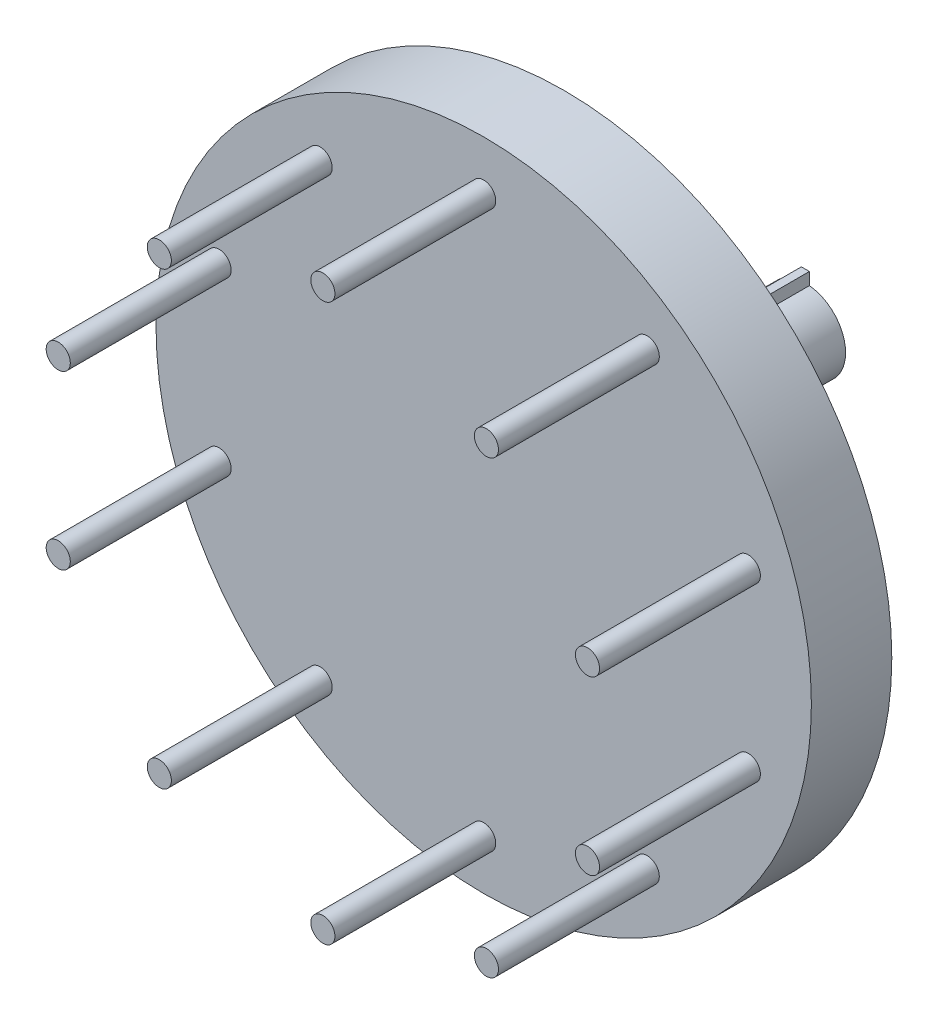
ISO-10303-21;
HEADER;
FILE_DESCRIPTION(('STEP AP214'),'2;1');
FILE_NAME('part.step','',(''),(''),'','','');
FILE_SCHEMA(('AUTOMOTIVE_DESIGN { 1 0 10303 214 1 1 1 1 }'));
ENDSEC;
DATA;
#1=APPLICATION_CONTEXT('core data for automotive mechanical design processes');
#2=APPLICATION_PROTOCOL_DEFINITION('international standard','automotive_design',2000,#1);
#3=PRODUCT_CONTEXT('',#1,'mechanical');
#4=PRODUCT('Part','Part','',(#3));
#5=PRODUCT_RELATED_PRODUCT_CATEGORY('part','',(#4));
#6=PRODUCT_DEFINITION_FORMATION('','',#4);
#7=PRODUCT_DEFINITION_CONTEXT('part definition',#1,'design');
#8=PRODUCT_DEFINITION('design','',#6,#7);
#9=PRODUCT_DEFINITION_SHAPE('','',#8);
#10=(LENGTH_UNIT() NAMED_UNIT(*) SI_UNIT(.MILLI.,.METRE.));
#11=(NAMED_UNIT(*) PLANE_ANGLE_UNIT() SI_UNIT($,.RADIAN.));
#12=(NAMED_UNIT(*) SI_UNIT($,.STERADIAN.) SOLID_ANGLE_UNIT());
#13=UNCERTAINTY_MEASURE_WITH_UNIT(LENGTH_MEASURE(1.E-05),#10,'distance_accuracy_value','');
#14=(GEOMETRIC_REPRESENTATION_CONTEXT(3) GLOBAL_UNCERTAINTY_ASSIGNED_CONTEXT((#13)) GLOBAL_UNIT_ASSIGNED_CONTEXT((#10,
#11,#12)) REPRESENTATION_CONTEXT('',''));
#15=CARTESIAN_POINT('',(0.,0.,0.));
#16=DIRECTION('',(0.,0.,1.));
#17=DIRECTION('',(1.,0.,0.));
#18=AXIS2_PLACEMENT_3D('',#15,#16,#17);
#19=CARTESIAN_POINT('',(0.,0.,-40.));
#20=DIRECTION('',(0.,0.,1.));
#21=DIRECTION('',(1.,0.,0.));
#22=AXIS2_PLACEMENT_3D('',#19,#20,#21);
#23=CYLINDRICAL_SURFACE('',#22,5.);
#24=CARTESIAN_POINT('',(0.,0.,-40.));
#25=DIRECTION('',(0.,0.,-1.));
#26=DIRECTION('',(-1.,0.,0.));
#27=AXIS2_PLACEMENT_3D('',#24,#25,#26);
#28=CIRCLE('',#27,5.);
#29=CARTESIAN_POINT('',(-0.5,-4.9749371855331,-40.));
#30=VERTEX_POINT('',#29);
#31=CARTESIAN_POINT('',(-0.5,4.9749371855331,-40.));
#32=VERTEX_POINT('',#31);
#33=EDGE_CURVE('E166',#30,#32,#28,.T.);
#34=ORIENTED_EDGE('',*,*,#33,.F.);
#35=DIRECTION('',(0.,0.,1.));
#36=VECTOR('',#35,1.);
#37=CARTESIAN_POINT('',(-0.5,-4.9749371855331,-40.));
#38=LINE('',#37,#36);
#39=CARTESIAN_POINT('',(-0.5,-4.9749371855331,-10.));
#40=VERTEX_POINT('',#39);
#41=EDGE_CURVE('E136',#30,#40,#38,.T.);
#42=ORIENTED_EDGE('',*,*,#41,.T.);
#43=CARTESIAN_POINT('',(0.,0.,-10.));
#44=DIRECTION('',(0.,0.,-1.));
#45=DIRECTION('',(-1.,0.,0.));
#46=AXIS2_PLACEMENT_3D('',#43,#44,#45);
#47=CIRCLE('',#46,5.);
#48=CARTESIAN_POINT('',(-0.5,4.9749371855331,-10.));
#49=VERTEX_POINT('',#48);
#50=EDGE_CURVE('E162',#40,#49,#47,.T.);
#51=ORIENTED_EDGE('',*,*,#50,.T.);
#52=DIRECTION('',(0.,0.,1.));
#53=VECTOR('',#52,1.);
#54=CARTESIAN_POINT('',(-0.5,4.9749371855331,-40.));
#55=LINE('',#54,#53);
#56=EDGE_CURVE('E154',#49,#32,#55,.F.);
#57=ORIENTED_EDGE('',*,*,#56,.T.);
#58=EDGE_LOOP('',(#34,#42,#51,#57));
#59=FACE_BOUND('',#58,.T.);
#60=ADVANCED_FACE('F36',(#59),#23,.T.);
#61=CARTESIAN_POINT('',(-32.9065554638116,10.6919880053722,20.));
#62=DIRECTION('',(0.,0.,-1.));
#63=DIRECTION('',(-1.,0.,0.));
#64=AXIS2_PLACEMENT_3D('',#61,#62,#63);
#65=CYLINDRICAL_SURFACE('',#64,1.5);
#66=CARTESIAN_POINT('',(-32.9065554638116,10.6919880053722,20.));
#67=DIRECTION('',(0.,0.,1.));
#68=DIRECTION('',(1.,0.,0.));
#69=AXIS2_PLACEMENT_3D('',#66,#67,#68);
#70=CIRCLE('',#69,1.5);
#71=CARTESIAN_POINT('',(-31.4065554638116,10.6919880053722,20.));
#72=VERTEX_POINT('',#71);
#73=EDGE_CURVE('E202',#72,#72,#70,.T.);
#74=ORIENTED_EDGE('',*,*,#73,.F.);
#75=EDGE_LOOP('',(#74));
#76=FACE_BOUND('',#75,.T.);
#77=CARTESIAN_POINT('',(-32.9065554638116,10.6919880053722,0.));
#78=DIRECTION('',(0.,0.,1.));
#79=DIRECTION('',(1.,0.,0.));
#80=AXIS2_PLACEMENT_3D('',#77,#78,#79);
#81=CIRCLE('',#80,1.5);
#82=CARTESIAN_POINT('',(-31.4065554638116,10.6919880053722,0.));
#83=VERTEX_POINT('',#82);
#84=EDGE_CURVE('E199',#83,#83,#81,.T.);
#85=ORIENTED_EDGE('',*,*,#84,.T.);
#86=EDGE_LOOP('',(#85));
#87=FACE_BOUND('',#86,.T.);
#88=ADVANCED_FACE('F38',(#76,#87),#65,.T.);
#89=CARTESIAN_POINT('',(0.,0.,20.));
#90=DIRECTION('',(0.,0.,1.));
#91=DIRECTION('',(1.,0.,0.));
#92=AXIS2_PLACEMENT_3D('',#89,#90,#91);
#93=PLANE('',#92);
#94=ORIENTED_EDGE('',*,*,#73,.T.);
#95=EDGE_LOOP('',(#94));
#96=FACE_BOUND('',#95,.T.);
#97=ADVANCED_FACE('F258',(#96),#93,.T.);
#98=CARTESIAN_POINT('',(0.,0.,-10.));
#99=DIRECTION('',(0.,0.,1.));
#100=DIRECTION('',(1.,0.,0.));
#101=AXIS2_PLACEMENT_3D('',#98,#99,#100);
#102=CYLINDRICAL_SURFACE('',#101,40.75);
#103=CARTESIAN_POINT('',(0.,0.,-10.));
#104=DIRECTION('',(0.,0.,-1.));
#105=DIRECTION('',(-1.,0.,0.));
#106=AXIS2_PLACEMENT_3D('',#103,#104,#105);
#107=CIRCLE('',#106,40.75);
#108=CARTESIAN_POINT('',(-40.75,0.,-10.));
#109=VERTEX_POINT('',#108);
#110=EDGE_CURVE('E196',#109,#109,#107,.T.);
#111=ORIENTED_EDGE('',*,*,#110,.F.);
#112=EDGE_LOOP('',(#111));
#113=FACE_BOUND('',#112,.T.);
#114=CARTESIAN_POINT('',(0.,0.,0.));
#115=DIRECTION('',(0.,0.,-1.));
#116=DIRECTION('',(-1.,0.,0.));
#117=AXIS2_PLACEMENT_3D('',#114,#115,#116);
#118=CIRCLE('',#117,40.75);
#119=CARTESIAN_POINT('',(-40.75,0.,0.));
#120=VERTEX_POINT('',#119);
#121=EDGE_CURVE('E195',#120,#120,#118,.T.);
#122=ORIENTED_EDGE('',*,*,#121,.T.);
#123=EDGE_LOOP('',(#122));
#124=FACE_BOUND('',#123,.T.);
#125=ADVANCED_FACE('F256',(#113,#124),#102,.T.);
#126=CARTESIAN_POINT('',(0.,0.,-10.));
#127=DIRECTION('',(0.,0.,-1.));
#128=DIRECTION('',(-1.,0.,0.));
#129=AXIS2_PLACEMENT_3D('',#126,#127,#128);
#130=PLANE('',#129);
#131=DIRECTION('',(0.,1.,0.));
#132=VECTOR('',#131,1.);
#133=CARTESIAN_POINT('',(-0.5,-4.5,-10.));
#134=LINE('',#133,#132);
#135=CARTESIAN_POINT('',(-0.5,-6.5,-10.));
#136=VERTEX_POINT('',#135);
#137=EDGE_CURVE('E115',#136,#40,#134,.T.);
#138=ORIENTED_EDGE('',*,*,#137,.F.);
#139=DIRECTION('',(-1.,0.,0.));
#140=VECTOR('',#139,1.);
#141=CARTESIAN_POINT('',(-0.5,-6.5,-10.));
#142=LINE('',#141,#140);
#143=CARTESIAN_POINT('',(0.5,-6.5,-10.));
#144=VERTEX_POINT('',#143);
#145=EDGE_CURVE('E114',#144,#136,#142,.T.);
#146=ORIENTED_EDGE('',*,*,#145,.F.);
#147=DIRECTION('',(0.,-1.,0.));
#148=VECTOR('',#147,1.);
#149=CARTESIAN_POINT('',(0.5,-6.5,-10.));
#150=LINE('',#149,#148);
#151=CARTESIAN_POINT('',(0.5,-4.9749371855331,-10.));
#152=VERTEX_POINT('',#151);
#153=EDGE_CURVE('E103',#152,#144,#150,.T.);
#154=ORIENTED_EDGE('',*,*,#153,.F.);
#155=CARTESIAN_POINT('',(0.5,4.9749371855331,-10.));
#156=VERTEX_POINT('',#155);
#157=EDGE_CURVE('E167',#156,#152,#47,.T.);
#158=ORIENTED_EDGE('',*,*,#157,.F.);
#159=DIRECTION('',(0.,-1.,0.));
#160=VECTOR('',#159,1.);
#161=CARTESIAN_POINT('',(0.5,6.5,-10.));
#162=LINE('',#161,#160);
#163=CARTESIAN_POINT('',(0.5,6.5,-10.));
#164=VERTEX_POINT('',#163);
#165=EDGE_CURVE('E139',#164,#156,#162,.T.);
#166=ORIENTED_EDGE('',*,*,#165,.F.);
#167=DIRECTION('',(1.,0.,0.));
#168=VECTOR('',#167,1.);
#169=CARTESIAN_POINT('',(-0.5,6.5,-10.));
#170=LINE('',#169,#168);
#171=CARTESIAN_POINT('',(-0.5,6.5,-10.));
#172=VERTEX_POINT('',#171);
#173=EDGE_CURVE('E144',#172,#164,#170,.T.);
#174=ORIENTED_EDGE('',*,*,#173,.F.);
#175=DIRECTION('',(0.,1.,0.));
#176=VECTOR('',#175,1.);
#177=CARTESIAN_POINT('',(-0.5,4.5,-10.));
#178=LINE('',#177,#176);
#179=EDGE_CURVE('E141',#49,#172,#178,.T.);
#180=ORIENTED_EDGE('',*,*,#179,.F.);
#181=ORIENTED_EDGE('',*,*,#50,.F.);
#182=EDGE_LOOP('',(#138,#146,#154,#158,#166,#174,#180,#181));
#183=FACE_BOUND('',#182,.T.);
#184=ORIENTED_EDGE('',*,*,#110,.T.);
#185=EDGE_LOOP('',(#184));
#186=FACE_BOUND('',#185,.T.);
#187=ADVANCED_FACE('F124',(#183,#186),#130,.T.);
#188=CARTESIAN_POINT('',(0.,0.,0.));
#189=DIRECTION('',(0.,0.,-1.));
#190=DIRECTION('',(-1.,0.,0.));
#191=AXIS2_PLACEMENT_3D('',#188,#189,#190);
#192=PLANE('',#191);
#193=CARTESIAN_POINT('',(1.95407045880881E-12,-34.6,0.));
#194=DIRECTION('',(0.,0.,-1.));
#195=DIRECTION('',(-1.,0.,0.));
#196=AXIS2_PLACEMENT_3D('',#193,#194,#195);
#197=CIRCLE('',#196,1.5);
#198=CARTESIAN_POINT('',(-1.49999999999805,-34.6,0.));
#199=VERTEX_POINT('',#198);
#200=EDGE_CURVE('E11',#199,#199,#197,.F.);
#201=ORIENTED_EDGE('',*,*,#200,.F.);
#202=EDGE_LOOP('',(#201));
#203=FACE_BOUND('',#202,.T.);
#204=CARTESIAN_POINT('',(20.3373697293213,-27.9919880053726,0.));
#205=DIRECTION('',(0.,0.,-1.));
#206=DIRECTION('',(-1.,0.,0.));
#207=AXIS2_PLACEMENT_3D('',#204,#205,#206);
#208=CIRCLE('',#207,1.5);
#209=CARTESIAN_POINT('',(18.8373697293213,-27.9919880053726,0.));
#210=VERTEX_POINT('',#209);
#211=EDGE_CURVE('E44',#210,#210,#208,.F.);
#212=ORIENTED_EDGE('',*,*,#211,.F.);
#213=EDGE_LOOP('',(#212));
#214=FACE_BOUND('',#213,.T.);
#215=CARTESIAN_POINT('',(32.9065554638136,-10.6919880053723,0.));
#216=DIRECTION('',(0.,0.,-1.));
#217=DIRECTION('',(-1.,0.,0.));
#218=AXIS2_PLACEMENT_3D('',#215,#216,#217);
#219=CIRCLE('',#218,1.5);
#220=CARTESIAN_POINT('',(31.4065554638136,-10.6919880053723,0.));
#221=VERTEX_POINT('',#220);
#222=EDGE_CURVE('E225',#221,#221,#219,.F.);
#223=ORIENTED_EDGE('',*,*,#222,.F.);
#224=EDGE_LOOP('',(#223));
#225=FACE_BOUND('',#224,.T.);
#226=CARTESIAN_POINT('',(32.906555463813,10.6919880053741,0.));
#227=DIRECTION('',(0.,0.,-1.));
#228=DIRECTION('',(-1.,0.,0.));
#229=AXIS2_PLACEMENT_3D('',#226,#227,#228);
#230=CIRCLE('',#229,1.5);
#231=CARTESIAN_POINT('',(31.406555463813,10.6919880053741,0.));
#232=VERTEX_POINT('',#231);
#233=EDGE_CURVE('E222',#232,#232,#230,.F.);
#234=ORIENTED_EDGE('',*,*,#233,.F.);
#235=EDGE_LOOP('',(#234));
#236=FACE_BOUND('',#235,.T.);
#237=CARTESIAN_POINT('',(20.3373697293196,27.9919880053732,0.));
#238=DIRECTION('',(0.,0.,-1.));
#239=DIRECTION('',(-1.,0.,0.));
#240=AXIS2_PLACEMENT_3D('',#237,#238,#239);
#241=CIRCLE('',#240,1.5);
#242=CARTESIAN_POINT('',(18.8373697293196,27.9919880053732,0.));
#243=VERTEX_POINT('',#242);
#244=EDGE_CURVE('E219',#243,#243,#241,.F.);
#245=ORIENTED_EDGE('',*,*,#244,.F.);
#246=EDGE_LOOP('',(#245));
#247=FACE_BOUND('',#246,.T.);
#248=CARTESIAN_POINT('',(0.,34.6,0.));
#249=DIRECTION('',(0.,0.,-1.));
#250=DIRECTION('',(-1.,0.,0.));
#251=AXIS2_PLACEMENT_3D('',#248,#249,#250);
#252=CIRCLE('',#251,1.5);
#253=CARTESIAN_POINT('',(-1.5,34.6,0.));
#254=VERTEX_POINT('',#253);
#255=EDGE_CURVE('E216',#254,#254,#252,.F.);
#256=ORIENTED_EDGE('',*,*,#255,.F.);
#257=EDGE_LOOP('',(#256));
#258=FACE_BOUND('',#257,.T.);
#259=CARTESIAN_POINT('',(-20.3373697293178,-27.9919880053738,0.));
#260=DIRECTION('',(0.,0.,-1.));
#261=DIRECTION('',(-1.,0.,0.));
#262=AXIS2_PLACEMENT_3D('',#259,#260,#261);
#263=CIRCLE('',#262,1.5);
#264=CARTESIAN_POINT('',(-21.8373697293178,-27.9919880053738,0.));
#265=VERTEX_POINT('',#264);
#266=EDGE_CURVE('E213',#265,#265,#263,.F.);
#267=ORIENTED_EDGE('',*,*,#266,.F.);
#268=EDGE_LOOP('',(#267));
#269=FACE_BOUND('',#268,.T.);
#270=CARTESIAN_POINT('',(-20.3373697293194,27.9919880053726,0.));
#271=DIRECTION('',(0.,0.,-1.));
#272=DIRECTION('',(-1.,0.,0.));
#273=AXIS2_PLACEMENT_3D('',#270,#271,#272);
#274=CIRCLE('',#273,1.5);
#275=CARTESIAN_POINT('',(-21.8373697293194,27.9919880053726,0.));
#276=VERTEX_POINT('',#275);
#277=EDGE_CURVE('E210',#276,#276,#274,.F.);
#278=ORIENTED_EDGE('',*,*,#277,.F.);
#279=EDGE_LOOP('',(#278));
#280=FACE_BOUND('',#279,.T.);
#281=CARTESIAN_POINT('',(-32.906555463811,-10.6919880053741,0.));
#282=DIRECTION('',(0.,0.,-1.));
#283=DIRECTION('',(-1.,0.,0.));
#284=AXIS2_PLACEMENT_3D('',#281,#282,#283);
#285=CIRCLE('',#284,1.5);
#286=CARTESIAN_POINT('',(-34.406555463811,-10.6919880053741,0.));
#287=VERTEX_POINT('',#286);
#288=EDGE_CURVE('E205',#287,#287,#285,.F.);
#289=ORIENTED_EDGE('',*,*,#288,.F.);
#290=EDGE_LOOP('',(#289));
#291=FACE_BOUND('',#290,.T.);
#292=ORIENTED_EDGE('',*,*,#84,.F.);
#293=EDGE_LOOP('',(#292));
#294=FACE_BOUND('',#293,.T.);
#295=ORIENTED_EDGE('',*,*,#121,.F.);
#296=EDGE_LOOP('',(#295));
#297=FACE_BOUND('',#296,.T.);
#298=ADVANCED_FACE('F232',(#203,#214,#225,#236,#247,#258,#269,#280,#291,#294,#297),#192,.F.);
#299=CARTESIAN_POINT('',(-32.906555463811,-10.6919880053741,20.));
#300=DIRECTION('',(0.,0.,-1.));
#301=DIRECTION('',(-1.,0.,0.));
#302=AXIS2_PLACEMENT_3D('',#299,#300,#301);
#303=CYLINDRICAL_SURFACE('',#302,1.5);
#304=CARTESIAN_POINT('',(-32.906555463811,-10.6919880053741,20.));
#305=DIRECTION('',(0.,0.,1.));
#306=DIRECTION('',(1.,0.,0.));
#307=AXIS2_PLACEMENT_3D('',#304,#305,#306);
#308=CIRCLE('',#307,1.5);
#309=CARTESIAN_POINT('',(-31.406555463811,-10.6919880053741,20.));
#310=VERTEX_POINT('',#309);
#311=EDGE_CURVE('E192',#310,#310,#308,.T.);
#312=ORIENTED_EDGE('',*,*,#311,.F.);
#313=EDGE_LOOP('',(#312));
#314=FACE_BOUND('',#313,.T.);
#315=ORIENTED_EDGE('',*,*,#288,.T.);
#316=EDGE_LOOP('',(#315));
#317=FACE_BOUND('',#316,.T.);
#318=ADVANCED_FACE('F235',(#314,#317),#303,.T.);
#319=CARTESIAN_POINT('',(0.,0.,20.));
#320=DIRECTION('',(0.,0.,1.));
#321=DIRECTION('',(1.,0.,0.));
#322=AXIS2_PLACEMENT_3D('',#319,#320,#321);
#323=PLANE('',#322);
#324=ORIENTED_EDGE('',*,*,#311,.T.);
#325=EDGE_LOOP('',(#324));
#326=FACE_BOUND('',#325,.T.);
#327=ADVANCED_FACE('F537',(#326),#323,.T.);
#328=CARTESIAN_POINT('',(-20.3373697293194,27.9919880053726,20.));
#329=DIRECTION('',(0.,0.,-1.));
#330=DIRECTION('',(-1.,0.,0.));
#331=AXIS2_PLACEMENT_3D('',#328,#329,#330);
#332=CYLINDRICAL_SURFACE('',#331,1.5);
#333=CARTESIAN_POINT('',(-20.3373697293194,27.9919880053726,20.));
#334=DIRECTION('',(0.,0.,1.));
#335=DIRECTION('',(1.,0.,0.));
#336=AXIS2_PLACEMENT_3D('',#333,#334,#335);
#337=CIRCLE('',#336,1.5);
#338=CARTESIAN_POINT('',(-18.8373697293194,27.9919880053726,20.));
#339=VERTEX_POINT('',#338);
#340=EDGE_CURVE('E189',#339,#339,#337,.T.);
#341=ORIENTED_EDGE('',*,*,#340,.F.);
#342=EDGE_LOOP('',(#341));
#343=FACE_BOUND('',#342,.T.);
#344=ORIENTED_EDGE('',*,*,#277,.T.);
#345=EDGE_LOOP('',(#344));
#346=FACE_BOUND('',#345,.T.);
#347=ADVANCED_FACE('F527',(#343,#346),#332,.T.);
#348=CARTESIAN_POINT('',(0.,0.,20.));
#349=DIRECTION('',(0.,0.,1.));
#350=DIRECTION('',(1.,0.,0.));
#351=AXIS2_PLACEMENT_3D('',#348,#349,#350);
#352=PLANE('',#351);
#353=ORIENTED_EDGE('',*,*,#340,.T.);
#354=EDGE_LOOP('',(#353));
#355=FACE_BOUND('',#354,.T.);
#356=ADVANCED_FACE('F516',(#355),#352,.T.);
#357=CARTESIAN_POINT('',(-20.3373697293178,-27.9919880053738,20.));
#358=DIRECTION('',(0.,0.,-1.));
#359=DIRECTION('',(-1.,0.,0.));
#360=AXIS2_PLACEMENT_3D('',#357,#358,#359);
#361=CYLINDRICAL_SURFACE('',#360,1.5);
#362=CARTESIAN_POINT('',(-20.3373697293178,-27.9919880053738,20.));
#363=DIRECTION('',(0.,0.,1.));
#364=DIRECTION('',(1.,0.,0.));
#365=AXIS2_PLACEMENT_3D('',#362,#363,#364);
#366=CIRCLE('',#365,1.5);
#367=CARTESIAN_POINT('',(-18.8373697293178,-27.9919880053738,20.));
#368=VERTEX_POINT('',#367);
#369=EDGE_CURVE('E186',#368,#368,#366,.T.);
#370=ORIENTED_EDGE('',*,*,#369,.F.);
#371=EDGE_LOOP('',(#370));
#372=FACE_BOUND('',#371,.T.);
#373=ORIENTED_EDGE('',*,*,#266,.T.);
#374=EDGE_LOOP('',(#373));
#375=FACE_BOUND('',#374,.T.);
#376=ADVANCED_FACE('F506',(#372,#375),#361,.T.);
#377=CARTESIAN_POINT('',(0.,0.,20.));
#378=DIRECTION('',(0.,0.,1.));
#379=DIRECTION('',(1.,0.,0.));
#380=AXIS2_PLACEMENT_3D('',#377,#378,#379);
#381=PLANE('',#380);
#382=ORIENTED_EDGE('',*,*,#369,.T.);
#383=EDGE_LOOP('',(#382));
#384=FACE_BOUND('',#383,.T.);
#385=ADVANCED_FACE('F495',(#384),#381,.T.);
#386=CARTESIAN_POINT('',(0.,34.6,20.));
#387=DIRECTION('',(0.,0.,-1.));
#388=DIRECTION('',(-1.,0.,0.));
#389=AXIS2_PLACEMENT_3D('',#386,#387,#388);
#390=CYLINDRICAL_SURFACE('',#389,1.5);
#391=CARTESIAN_POINT('',(0.,34.6,20.));
#392=DIRECTION('',(0.,0.,1.));
#393=DIRECTION('',(1.,0.,0.));
#394=AXIS2_PLACEMENT_3D('',#391,#392,#393);
#395=CIRCLE('',#394,1.5);
#396=CARTESIAN_POINT('',(1.5,34.6,20.));
#397=VERTEX_POINT('',#396);
#398=EDGE_CURVE('E183',#397,#397,#395,.T.);
#399=ORIENTED_EDGE('',*,*,#398,.F.);
#400=EDGE_LOOP('',(#399));
#401=FACE_BOUND('',#400,.T.);
#402=ORIENTED_EDGE('',*,*,#255,.T.);
#403=EDGE_LOOP('',(#402));
#404=FACE_BOUND('',#403,.T.);
#405=ADVANCED_FACE('F485',(#401,#404),#390,.T.);
#406=CARTESIAN_POINT('',(0.,0.,20.));
#407=DIRECTION('',(0.,0.,1.));
#408=DIRECTION('',(1.,0.,0.));
#409=AXIS2_PLACEMENT_3D('',#406,#407,#408);
#410=PLANE('',#409);
#411=ORIENTED_EDGE('',*,*,#398,.T.);
#412=EDGE_LOOP('',(#411));
#413=FACE_BOUND('',#412,.T.);
#414=ADVANCED_FACE('F474',(#413),#410,.T.);
#415=CARTESIAN_POINT('',(20.3373697293196,27.9919880053732,20.));
#416=DIRECTION('',(0.,0.,-1.));
#417=DIRECTION('',(-1.,0.,0.));
#418=AXIS2_PLACEMENT_3D('',#415,#416,#417);
#419=CYLINDRICAL_SURFACE('',#418,1.5);
#420=CARTESIAN_POINT('',(20.3373697293196,27.9919880053732,20.));
#421=DIRECTION('',(0.,0.,1.));
#422=DIRECTION('',(1.,0.,0.));
#423=AXIS2_PLACEMENT_3D('',#420,#421,#422);
#424=CIRCLE('',#423,1.5);
#425=CARTESIAN_POINT('',(21.8373697293196,27.9919880053732,20.));
#426=VERTEX_POINT('',#425);
#427=EDGE_CURVE('E180',#426,#426,#424,.T.);
#428=ORIENTED_EDGE('',*,*,#427,.F.);
#429=EDGE_LOOP('',(#428));
#430=FACE_BOUND('',#429,.T.);
#431=ORIENTED_EDGE('',*,*,#244,.T.);
#432=EDGE_LOOP('',(#431));
#433=FACE_BOUND('',#432,.T.);
#434=ADVANCED_FACE('F464',(#430,#433),#419,.T.);
#435=CARTESIAN_POINT('',(0.,0.,20.));
#436=DIRECTION('',(0.,0.,1.));
#437=DIRECTION('',(1.,0.,0.));
#438=AXIS2_PLACEMENT_3D('',#435,#436,#437);
#439=PLANE('',#438);
#440=ORIENTED_EDGE('',*,*,#427,.T.);
#441=EDGE_LOOP('',(#440));
#442=FACE_BOUND('',#441,.T.);
#443=ADVANCED_FACE('F453',(#442),#439,.T.);
#444=CARTESIAN_POINT('',(32.906555463813,10.6919880053741,20.));
#445=DIRECTION('',(0.,0.,-1.));
#446=DIRECTION('',(-1.,0.,0.));
#447=AXIS2_PLACEMENT_3D('',#444,#445,#446);
#448=CYLINDRICAL_SURFACE('',#447,1.5);
#449=CARTESIAN_POINT('',(32.906555463813,10.6919880053741,20.));
#450=DIRECTION('',(0.,0.,1.));
#451=DIRECTION('',(1.,0.,0.));
#452=AXIS2_PLACEMENT_3D('',#449,#450,#451);
#453=CIRCLE('',#452,1.5);
#454=CARTESIAN_POINT('',(34.406555463813,10.6919880053741,20.));
#455=VERTEX_POINT('',#454);
#456=EDGE_CURVE('E177',#455,#455,#453,.T.);
#457=ORIENTED_EDGE('',*,*,#456,.F.);
#458=EDGE_LOOP('',(#457));
#459=FACE_BOUND('',#458,.T.);
#460=ORIENTED_EDGE('',*,*,#233,.T.);
#461=EDGE_LOOP('',(#460));
#462=FACE_BOUND('',#461,.T.);
#463=ADVANCED_FACE('F443',(#459,#462),#448,.T.);
#464=CARTESIAN_POINT('',(0.,0.,20.));
#465=DIRECTION('',(0.,0.,1.));
#466=DIRECTION('',(1.,0.,0.));
#467=AXIS2_PLACEMENT_3D('',#464,#465,#466);
#468=PLANE('',#467);
#469=ORIENTED_EDGE('',*,*,#456,.T.);
#470=EDGE_LOOP('',(#469));
#471=FACE_BOUND('',#470,.T.);
#472=ADVANCED_FACE('F432',(#471),#468,.T.);
#473=CARTESIAN_POINT('',(32.9065554638136,-10.6919880053723,20.));
#474=DIRECTION('',(0.,0.,-1.));
#475=DIRECTION('',(-1.,0.,0.));
#476=AXIS2_PLACEMENT_3D('',#473,#474,#475);
#477=CYLINDRICAL_SURFACE('',#476,1.5);
#478=CARTESIAN_POINT('',(32.9065554638136,-10.6919880053723,20.));
#479=DIRECTION('',(0.,0.,1.));
#480=DIRECTION('',(1.,0.,0.));
#481=AXIS2_PLACEMENT_3D('',#478,#479,#480);
#482=CIRCLE('',#481,1.5);
#483=CARTESIAN_POINT('',(34.4065554638136,-10.6919880053723,20.));
#484=VERTEX_POINT('',#483);
#485=EDGE_CURVE('E174',#484,#484,#482,.T.);
#486=ORIENTED_EDGE('',*,*,#485,.F.);
#487=EDGE_LOOP('',(#486));
#488=FACE_BOUND('',#487,.T.);
#489=ORIENTED_EDGE('',*,*,#222,.T.);
#490=EDGE_LOOP('',(#489));
#491=FACE_BOUND('',#490,.T.);
#492=ADVANCED_FACE('F422',(#488,#491),#477,.T.);
#493=CARTESIAN_POINT('',(0.,0.,20.));
#494=DIRECTION('',(0.,0.,1.));
#495=DIRECTION('',(1.,0.,0.));
#496=AXIS2_PLACEMENT_3D('',#493,#494,#495);
#497=PLANE('',#496);
#498=ORIENTED_EDGE('',*,*,#485,.T.);
#499=EDGE_LOOP('',(#498));
#500=FACE_BOUND('',#499,.T.);
#501=ADVANCED_FACE('F411',(#500),#497,.T.);
#502=CARTESIAN_POINT('',(20.3373697293213,-27.9919880053726,20.));
#503=DIRECTION('',(0.,0.,-1.));
#504=DIRECTION('',(-1.,0.,0.));
#505=AXIS2_PLACEMENT_3D('',#502,#503,#504);
#506=CYLINDRICAL_SURFACE('',#505,1.5);
#507=CARTESIAN_POINT('',(20.3373697293213,-27.9919880053726,20.));
#508=DIRECTION('',(0.,0.,1.));
#509=DIRECTION('',(1.,0.,0.));
#510=AXIS2_PLACEMENT_3D('',#507,#508,#509);
#511=CIRCLE('',#510,1.5);
#512=CARTESIAN_POINT('',(21.8373697293213,-27.9919880053726,20.));
#513=VERTEX_POINT('',#512);
#514=EDGE_CURVE('E171',#513,#513,#511,.T.);
#515=ORIENTED_EDGE('',*,*,#514,.F.);
#516=EDGE_LOOP('',(#515));
#517=FACE_BOUND('',#516,.T.);
#518=ORIENTED_EDGE('',*,*,#211,.T.);
#519=EDGE_LOOP('',(#518));
#520=FACE_BOUND('',#519,.T.);
#521=ADVANCED_FACE('F230',(#517,#520),#506,.T.);
#522=CARTESIAN_POINT('',(0.,0.,20.));
#523=DIRECTION('',(0.,0.,1.));
#524=DIRECTION('',(1.,0.,0.));
#525=AXIS2_PLACEMENT_3D('',#522,#523,#524);
#526=PLANE('',#525);
#527=ORIENTED_EDGE('',*,*,#514,.T.);
#528=EDGE_LOOP('',(#527));
#529=FACE_BOUND('',#528,.T.);
#530=ADVANCED_FACE('F391',(#529),#526,.T.);
#531=CARTESIAN_POINT('',(1.95407045880881E-12,-34.6,20.));
#532=DIRECTION('',(0.,0.,-1.));
#533=DIRECTION('',(-1.,0.,0.));
#534=AXIS2_PLACEMENT_3D('',#531,#532,#533);
#535=CYLINDRICAL_SURFACE('',#534,1.5);
#536=CARTESIAN_POINT('',(1.95407045880881E-12,-34.6,20.));
#537=DIRECTION('',(0.,0.,1.));
#538=DIRECTION('',(1.,0.,0.));
#539=AXIS2_PLACEMENT_3D('',#536,#537,#538);
#540=CIRCLE('',#539,1.5);
#541=CARTESIAN_POINT('',(1.50000000000195,-34.6,20.));
#542=VERTEX_POINT('',#541);
#543=EDGE_CURVE('E165',#542,#542,#540,.T.);
#544=ORIENTED_EDGE('',*,*,#543,.F.);
#545=EDGE_LOOP('',(#544));
#546=FACE_BOUND('',#545,.T.);
#547=ORIENTED_EDGE('',*,*,#200,.T.);
#548=EDGE_LOOP('',(#547));
#549=FACE_BOUND('',#548,.T.);
#550=ADVANCED_FACE('F288',(#546,#549),#535,.T.);
#551=CARTESIAN_POINT('',(0.,0.,20.));
#552=DIRECTION('',(0.,0.,1.));
#553=DIRECTION('',(1.,0.,0.));
#554=AXIS2_PLACEMENT_3D('',#551,#552,#553);
#555=PLANE('',#554);
#556=ORIENTED_EDGE('',*,*,#543,.T.);
#557=EDGE_LOOP('',(#556));
#558=FACE_BOUND('',#557,.T.);
#559=ADVANCED_FACE('F281',(#558),#555,.T.);
#560=ORIENTED_EDGE('',*,*,#157,.T.);
#561=DIRECTION('',(0.,0.,1.));
#562=VECTOR('',#561,1.);
#563=CARTESIAN_POINT('',(0.5,-4.9749371855331,-40.));
#564=LINE('',#563,#562);
#565=CARTESIAN_POINT('',(0.5,-4.9749371855331,-40.));
#566=VERTEX_POINT('',#565);
#567=EDGE_CURVE('E109',#152,#566,#564,.F.);
#568=ORIENTED_EDGE('',*,*,#567,.T.);
#569=CARTESIAN_POINT('',(0.5,4.9749371855331,-40.));
#570=VERTEX_POINT('',#569);
#571=EDGE_CURVE('E163',#570,#566,#28,.T.);
#572=ORIENTED_EDGE('',*,*,#571,.F.);
#573=DIRECTION('',(0.,0.,1.));
#574=VECTOR('',#573,1.);
#575=CARTESIAN_POINT('',(0.5,4.9749371855331,-40.));
#576=LINE('',#575,#574);
#577=EDGE_CURVE('E159',#570,#156,#576,.T.);
#578=ORIENTED_EDGE('',*,*,#577,.T.);
#579=EDGE_LOOP('',(#560,#568,#572,#578));
#580=FACE_BOUND('',#579,.T.);
#581=ADVANCED_FACE('F271',(#580),#23,.T.);
#582=CARTESIAN_POINT('',(0.,0.,-40.));
#583=DIRECTION('',(0.,0.,-1.));
#584=DIRECTION('',(-1.,0.,0.));
#585=AXIS2_PLACEMENT_3D('',#582,#583,#584);
#586=PLANE('',#585);
#587=ORIENTED_EDGE('',*,*,#571,.T.);
#588=DIRECTION('',(0.,-1.,0.));
#589=VECTOR('',#588,1.);
#590=CARTESIAN_POINT('',(0.5,-6.5,-40.));
#591=LINE('',#590,#589);
#592=CARTESIAN_POINT('',(0.5,-6.5,-40.));
#593=VERTEX_POINT('',#592);
#594=EDGE_CURVE('E131',#566,#593,#591,.T.);
#595=ORIENTED_EDGE('',*,*,#594,.T.);
#596=DIRECTION('',(-1.,0.,0.));
#597=VECTOR('',#596,1.);
#598=CARTESIAN_POINT('',(-0.5,-6.5,-40.));
#599=LINE('',#598,#597);
#600=CARTESIAN_POINT('',(-0.5,-6.5,-40.));
#601=VERTEX_POINT('',#600);
#602=EDGE_CURVE('E121',#593,#601,#599,.T.);
#603=ORIENTED_EDGE('',*,*,#602,.T.);
#604=DIRECTION('',(0.,1.,0.));
#605=VECTOR('',#604,1.);
#606=CARTESIAN_POINT('',(-0.5,-4.5,-40.));
#607=LINE('',#606,#605);
#608=EDGE_CURVE('E51',#601,#30,#607,.T.);
#609=ORIENTED_EDGE('',*,*,#608,.T.);
#610=ORIENTED_EDGE('',*,*,#33,.T.);
#611=DIRECTION('',(0.,1.,0.));
#612=VECTOR('',#611,1.);
#613=CARTESIAN_POINT('',(-0.5,4.5,-40.));
#614=LINE('',#613,#612);
#615=CARTESIAN_POINT('',(-0.5,6.5,-40.));
#616=VERTEX_POINT('',#615);
#617=EDGE_CURVE('E149',#32,#616,#614,.T.);
#618=ORIENTED_EDGE('',*,*,#617,.T.);
#619=DIRECTION('',(1.,0.,0.));
#620=VECTOR('',#619,1.);
#621=CARTESIAN_POINT('',(-0.5,6.5,-40.));
#622=LINE('',#621,#620);
#623=CARTESIAN_POINT('',(0.5,6.5,-40.));
#624=VERTEX_POINT('',#623);
#625=EDGE_CURVE('E142',#616,#624,#622,.T.);
#626=ORIENTED_EDGE('',*,*,#625,.T.);
#627=DIRECTION('',(0.,-1.,0.));
#628=VECTOR('',#627,1.);
#629=CARTESIAN_POINT('',(0.5,6.5,-40.));
#630=LINE('',#629,#628);
#631=EDGE_CURVE('E58',#624,#570,#630,.T.);
#632=ORIENTED_EDGE('',*,*,#631,.T.);
#633=EDGE_LOOP('',(#587,#595,#603,#609,#610,#618,#626,#632));
#634=FACE_BOUND('',#633,.T.);
#635=ADVANCED_FACE('F280',(#634),#586,.T.);
#636=CARTESIAN_POINT('',(0.5,6.5,-10.));
#637=DIRECTION('',(1.,0.,0.));
#638=DIRECTION('',(0.,1.,0.));
#639=AXIS2_PLACEMENT_3D('',#636,#637,#638);
#640=PLANE('',#639);
#641=ORIENTED_EDGE('',*,*,#577,.F.);
#642=ORIENTED_EDGE('',*,*,#631,.F.);
#643=DIRECTION('',(0.,0.,-1.));
#644=VECTOR('',#643,1.);
#645=CARTESIAN_POINT('',(0.5,6.5,-10.));
#646=LINE('',#645,#644);
#647=EDGE_CURVE('E152',#164,#624,#646,.T.);
#648=ORIENTED_EDGE('',*,*,#647,.F.);
#649=ORIENTED_EDGE('',*,*,#165,.T.);
#650=EDGE_LOOP('',(#641,#642,#648,#649));
#651=FACE_BOUND('',#650,.T.);
#652=ADVANCED_FACE('F287',(#651),#640,.T.);
#653=CARTESIAN_POINT('',(-0.5,4.5,-10.));
#654=DIRECTION('',(-1.,0.,0.));
#655=DIRECTION('',(0.,0.,1.));
#656=AXIS2_PLACEMENT_3D('',#653,#654,#655);
#657=PLANE('',#656);
#658=ORIENTED_EDGE('',*,*,#56,.F.);
#659=ORIENTED_EDGE('',*,*,#179,.T.);
#660=DIRECTION('',(0.,0.,-1.));
#661=VECTOR('',#660,1.);
#662=CARTESIAN_POINT('',(-0.5,6.5,-10.));
#663=LINE('',#662,#661);
#664=EDGE_CURVE('E147',#172,#616,#663,.T.);
#665=ORIENTED_EDGE('',*,*,#664,.T.);
#666=ORIENTED_EDGE('',*,*,#617,.F.);
#667=EDGE_LOOP('',(#658,#659,#665,#666));
#668=FACE_BOUND('',#667,.T.);
#669=ADVANCED_FACE('F302',(#668),#657,.T.);
#670=CARTESIAN_POINT('',(-0.5,6.5,-10.));
#671=DIRECTION('',(0.,1.,0.));
#672=DIRECTION('',(0.,0.,1.));
#673=AXIS2_PLACEMENT_3D('',#670,#671,#672);
#674=PLANE('',#673);
#675=ORIENTED_EDGE('',*,*,#625,.F.);
#676=ORIENTED_EDGE('',*,*,#664,.F.);
#677=ORIENTED_EDGE('',*,*,#173,.T.);
#678=ORIENTED_EDGE('',*,*,#647,.T.);
#679=EDGE_LOOP('',(#675,#676,#677,#678));
#680=FACE_BOUND('',#679,.T.);
#681=ADVANCED_FACE('F298',(#680),#674,.T.);
#682=CARTESIAN_POINT('',(-0.5,-4.5,-10.));
#683=DIRECTION('',(-1.,0.,0.));
#684=DIRECTION('',(0.,0.,1.));
#685=AXIS2_PLACEMENT_3D('',#682,#683,#684);
#686=PLANE('',#685);
#687=ORIENTED_EDGE('',*,*,#41,.F.);
#688=ORIENTED_EDGE('',*,*,#608,.F.);
#689=DIRECTION('',(0.,0.,-1.));
#690=VECTOR('',#689,1.);
#691=CARTESIAN_POINT('',(-0.5,-6.5,-10.));
#692=LINE('',#691,#690);
#693=EDGE_CURVE('E122',#136,#601,#692,.T.);
#694=ORIENTED_EDGE('',*,*,#693,.F.);
#695=ORIENTED_EDGE('',*,*,#137,.T.);
#696=EDGE_LOOP('',(#687,#688,#694,#695));
#697=FACE_BOUND('',#696,.T.);
#698=ADVANCED_FACE('F304',(#697),#686,.T.);
#699=CARTESIAN_POINT('',(0.5,-6.5,-10.));
#700=DIRECTION('',(1.,0.,0.));
#701=DIRECTION('',(0.,1.,0.));
#702=AXIS2_PLACEMENT_3D('',#699,#700,#701);
#703=PLANE('',#702);
#704=ORIENTED_EDGE('',*,*,#567,.F.);
#705=ORIENTED_EDGE('',*,*,#153,.T.);
#706=DIRECTION('',(0.,0.,-1.));
#707=VECTOR('',#706,1.);
#708=CARTESIAN_POINT('',(0.5,-6.5,-10.));
#709=LINE('',#708,#707);
#710=EDGE_CURVE('E106',#144,#593,#709,.T.);
#711=ORIENTED_EDGE('',*,*,#710,.T.);
#712=ORIENTED_EDGE('',*,*,#594,.F.);
#713=EDGE_LOOP('',(#704,#705,#711,#712));
#714=FACE_BOUND('',#713,.T.);
#715=ADVANCED_FACE('F105',(#714),#703,.T.);
#716=CARTESIAN_POINT('',(-0.5,-6.5,-10.));
#717=DIRECTION('',(0.,-1.,0.));
#718=DIRECTION('',(0.,0.,-1.));
#719=AXIS2_PLACEMENT_3D('',#716,#717,#718);
#720=PLANE('',#719);
#721=ORIENTED_EDGE('',*,*,#602,.F.);
#722=ORIENTED_EDGE('',*,*,#710,.F.);
#723=ORIENTED_EDGE('',*,*,#145,.T.);
#724=ORIENTED_EDGE('',*,*,#693,.T.);
#725=EDGE_LOOP('',(#721,#722,#723,#724));
#726=FACE_BOUND('',#725,.T.);
#727=ADVANCED_FACE('F119',(#726),#720,.T.);
#728=CLOSED_SHELL('',(#60,#88,#97,#125,#187,#298,#318,#327,#347,#356,#376,#385,#405,#414,#434,
#443,#463,#472,#492,#501,#521,#530,#550,#559,#581,#635,#652,#669,#681,#698,#715,#727));
#729=MANIFOLD_SOLID_BREP('B2',#728);
#730=ADVANCED_BREP_SHAPE_REPRESENTATION('',(#18,#729),#14);
#731=SHAPE_DEFINITION_REPRESENTATION(#9,#730);
ENDSEC;
END-ISO-10303-21;
